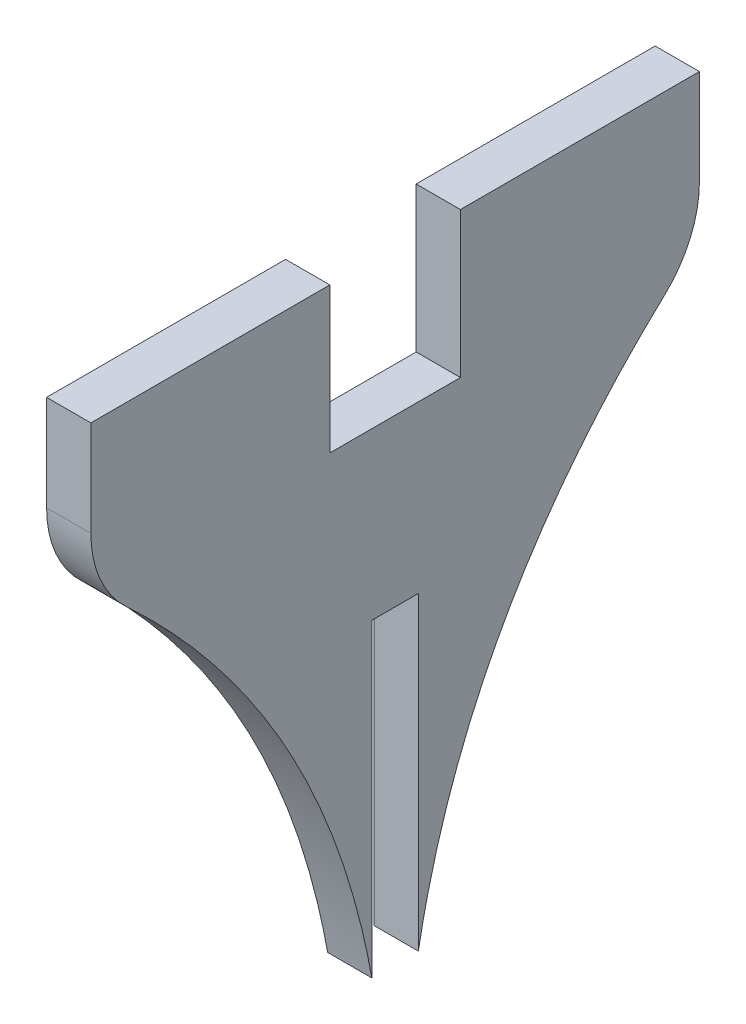
ISO-10303-21;
HEADER;
FILE_DESCRIPTION(('STEP AP214'),'2;1');
FILE_NAME('part.step','',(''),(''),'','','');
FILE_SCHEMA(('AUTOMOTIVE_DESIGN { 1 0 10303 214 1 1 1 1 }'));
ENDSEC;
DATA;
#1=APPLICATION_CONTEXT('core data for automotive mechanical design processes');
#2=APPLICATION_PROTOCOL_DEFINITION('international standard','automotive_design',2000,#1);
#3=PRODUCT_CONTEXT('',#1,'mechanical');
#4=PRODUCT('Part','Part','',(#3));
#5=PRODUCT_RELATED_PRODUCT_CATEGORY('part','',(#4));
#6=PRODUCT_DEFINITION_FORMATION('','',#4);
#7=PRODUCT_DEFINITION_CONTEXT('part definition',#1,'design');
#8=PRODUCT_DEFINITION('design','',#6,#7);
#9=PRODUCT_DEFINITION_SHAPE('','',#8);
#10=(LENGTH_UNIT() NAMED_UNIT(*) SI_UNIT(.MILLI.,.METRE.));
#11=(NAMED_UNIT(*) PLANE_ANGLE_UNIT() SI_UNIT($,.RADIAN.));
#12=(NAMED_UNIT(*) SI_UNIT($,.STERADIAN.) SOLID_ANGLE_UNIT());
#13=UNCERTAINTY_MEASURE_WITH_UNIT(LENGTH_MEASURE(1.E-05),#10,'distance_accuracy_value','');
#14=(GEOMETRIC_REPRESENTATION_CONTEXT(3) GLOBAL_UNCERTAINTY_ASSIGNED_CONTEXT((#13)) GLOBAL_UNIT_ASSIGNED_CONTEXT((#10,
#11,#12)) REPRESENTATION_CONTEXT('',''));
#15=CARTESIAN_POINT('',(0.,0.,0.));
#16=DIRECTION('',(0.,0.,1.));
#17=DIRECTION('',(1.,0.,0.));
#18=AXIS2_PLACEMENT_3D('',#15,#16,#17);
#19=CARTESIAN_POINT('',(4.,13.15,27.5));
#20=DIRECTION('',(0.,0.,-1.));
#21=DIRECTION('',(0.,1.,0.));
#22=AXIS2_PLACEMENT_3D('',#19,#20,#21);
#23=PLANE('',#22);
#24=DIRECTION('',(0.,-1.,0.));
#25=VECTOR('',#24,1.);
#26=CARTESIAN_POINT('',(0.,13.15,27.5));
#27=LINE('',#26,#25);
#28=CARTESIAN_POINT('',(0.,13.15,27.5));
#29=VERTEX_POINT('',#28);
#30=CARTESIAN_POINT('',(0.,4.50441857075632,27.5));
#31=VERTEX_POINT('',#30);
#32=EDGE_CURVE('E237',#29,#31,#27,.T.);
#33=ORIENTED_EDGE('',*,*,#32,.T.);
#34=DIRECTION('',(-1.,0.,0.));
#35=VECTOR('',#34,1.);
#36=CARTESIAN_POINT('',(4.,4.50441857075632,27.5));
#37=LINE('',#36,#35);
#38=CARTESIAN_POINT('',(4.,4.50441857075632,27.5));
#39=VERTEX_POINT('',#38);
#40=EDGE_CURVE('E12',#31,#39,#37,.F.);
#41=ORIENTED_EDGE('',*,*,#40,.T.);
#42=DIRECTION('',(0.,-1.,0.));
#43=VECTOR('',#42,1.);
#44=CARTESIAN_POINT('',(4.,13.15,27.5));
#45=LINE('',#44,#43);
#46=CARTESIAN_POINT('',(4.,13.15,27.5));
#47=VERTEX_POINT('',#46);
#48=EDGE_CURVE('E153',#47,#39,#45,.T.);
#49=ORIENTED_EDGE('',*,*,#48,.F.);
#50=DIRECTION('',(-1.,0.,0.));
#51=VECTOR('',#50,1.);
#52=CARTESIAN_POINT('',(4.,13.15,27.5));
#53=LINE('',#52,#51);
#54=EDGE_CURVE('E236',#47,#29,#53,.T.);
#55=ORIENTED_EDGE('',*,*,#54,.T.);
#56=EDGE_LOOP('',(#33,#41,#49,#55));
#57=FACE_BOUND('',#56,.T.);
#58=ADVANCED_FACE('F43',(#57),#23,.F.);
#59=CARTESIAN_POINT('',(4.,0.,27.5));
#60=CARTESIAN_POINT('',(4.,-17.4603501906166,6.73618191201682));
#61=CARTESIAN_POINT('',(4.,-43.,2.1));
#62=B_SPLINE_CURVE_WITH_KNOTS('',2,(#59,#60,#61),.UNSPECIFIED.,.F.,.F.,(3,3),(0.,1.),.UNSPECIFIED.);
#63=DIRECTION('',(-1.,0.,0.));
#64=VECTOR('',#63,1.);
#65=SURFACE_OF_LINEAR_EXTRUSION('',#62,#64);
#66=CARTESIAN_POINT('',(4.,-2.82181639797556,24.3063412479048));
#67=VERTEX_POINT('',#66);
#68=CARTESIAN_POINT('',(4.,-43.,2.1));
#69=VERTEX_POINT('',#68);
#70=EDGE_CURVE('E142',#67,#69,#62,.T.);
#71=ORIENTED_EDGE('',*,*,#70,.F.);
#72=DIRECTION('',(-1.,0.,0.));
#73=VECTOR('',#72,1.);
#74=CARTESIAN_POINT('',(4.,-2.82181639797556,24.3063412479048));
#75=LINE('',#74,#73);
#76=CARTESIAN_POINT('',(0.,-2.82181639797556,24.3063412479048));
#77=VERTEX_POINT('',#76);
#78=EDGE_CURVE('E52',#67,#77,#75,.T.);
#79=ORIENTED_EDGE('',*,*,#78,.T.);
#80=CARTESIAN_POINT('',(0.,0.,27.5));
#81=CARTESIAN_POINT('',(0.,-17.4603501906166,6.73618191201682));
#82=CARTESIAN_POINT('',(0.,-43.,2.1));
#83=B_SPLINE_CURVE_WITH_KNOTS('',2,(#80,#81,#82),.UNSPECIFIED.,.F.,.F.,(3,3),(0.,1.),.UNSPECIFIED.);
#84=CARTESIAN_POINT('',(0.,-43.,2.1));
#85=VERTEX_POINT('',#84);
#86=EDGE_CURVE('E159',#77,#85,#83,.T.);
#87=ORIENTED_EDGE('',*,*,#86,.T.);
#88=DIRECTION('',(-1.,0.,0.));
#89=VECTOR('',#88,1.);
#90=CARTESIAN_POINT('',(4.,-43.,2.1));
#91=LINE('',#90,#89);
#92=EDGE_CURVE('E156',#69,#85,#91,.T.);
#93=ORIENTED_EDGE('',*,*,#92,.F.);
#94=EDGE_LOOP('',(#71,#79,#87,#93));
#95=FACE_BOUND('',#94,.T.);
#96=ADVANCED_FACE('F157',(#95),#65,.F.);
#97=CARTESIAN_POINT('',(4.,-43.,2.1));
#98=DIRECTION('',(0.,0.,1.));
#99=DIRECTION('',(0.,-1.,0.));
#100=AXIS2_PLACEMENT_3D('',#97,#98,#99);
#101=PLANE('',#100);
#102=DIRECTION('',(0.,1.,0.));
#103=VECTOR('',#102,1.);
#104=CARTESIAN_POINT('',(0.,-43.,2.1));
#105=LINE('',#104,#103);
#106=CARTESIAN_POINT('',(0.,-15.,2.1));
#107=VERTEX_POINT('',#106);
#108=EDGE_CURVE('E244',#85,#107,#105,.T.);
#109=ORIENTED_EDGE('',*,*,#108,.T.);
#110=DIRECTION('',(-1.,0.,0.));
#111=VECTOR('',#110,1.);
#112=CARTESIAN_POINT('',(4.,-15.,2.1));
#113=LINE('',#112,#111);
#114=CARTESIAN_POINT('',(4.,-15.,2.1));
#115=VERTEX_POINT('',#114);
#116=EDGE_CURVE('E164',#115,#107,#113,.T.);
#117=ORIENTED_EDGE('',*,*,#116,.F.);
#118=DIRECTION('',(0.,1.,0.));
#119=VECTOR('',#118,1.);
#120=CARTESIAN_POINT('',(4.,-43.,2.1));
#121=LINE('',#120,#119);
#122=EDGE_CURVE('E147',#69,#115,#121,.T.);
#123=ORIENTED_EDGE('',*,*,#122,.F.);
#124=ORIENTED_EDGE('',*,*,#92,.T.);
#125=EDGE_LOOP('',(#109,#117,#123,#124));
#126=FACE_BOUND('',#125,.T.);
#127=ADVANCED_FACE('F166',(#126),#101,.F.);
#128=CARTESIAN_POINT('',(4.,-15.,2.1));
#129=DIRECTION('',(0.,1.,0.));
#130=DIRECTION('',(0.,0.,1.));
#131=AXIS2_PLACEMENT_3D('',#128,#129,#130);
#132=PLANE('',#131);
#133=DIRECTION('',(0.,0.,-1.));
#134=VECTOR('',#133,1.);
#135=CARTESIAN_POINT('',(0.,-15.,2.1));
#136=LINE('',#135,#134);
#137=CARTESIAN_POINT('',(0.,-15.,-2.1));
#138=VERTEX_POINT('',#137);
#139=EDGE_CURVE('E250',#107,#138,#136,.T.);
#140=ORIENTED_EDGE('',*,*,#139,.T.);
#141=DIRECTION('',(-1.,0.,0.));
#142=VECTOR('',#141,1.);
#143=CARTESIAN_POINT('',(4.,-15.,-2.1));
#144=LINE('',#143,#142);
#145=CARTESIAN_POINT('',(4.,-15.,-2.1));
#146=VERTEX_POINT('',#145);
#147=EDGE_CURVE('E311',#146,#138,#144,.T.);
#148=ORIENTED_EDGE('',*,*,#147,.F.);
#149=DIRECTION('',(0.,0.,-1.));
#150=VECTOR('',#149,1.);
#151=CARTESIAN_POINT('',(4.,-15.,2.1));
#152=LINE('',#151,#150);
#153=EDGE_CURVE('E170',#115,#146,#152,.T.);
#154=ORIENTED_EDGE('',*,*,#153,.F.);
#155=ORIENTED_EDGE('',*,*,#116,.T.);
#156=EDGE_LOOP('',(#140,#148,#154,#155));
#157=FACE_BOUND('',#156,.T.);
#158=ADVANCED_FACE('F377',(#157),#132,.F.);
#159=CARTESIAN_POINT('',(4.,-43.,-2.10000000000001));
#160=DIRECTION('',(0.,0.,1.));
#161=DIRECTION('',(0.,-1.,0.));
#162=AXIS2_PLACEMENT_3D('',#159,#160,#161);
#163=PLANE('',#162);
#164=DIRECTION('',(0.,1.,0.));
#165=VECTOR('',#164,1.);
#166=CARTESIAN_POINT('',(0.,-43.,-2.10000000000001));
#167=LINE('',#166,#165);
#168=CARTESIAN_POINT('',(0.,-43.,-2.10000000000001));
#169=VERTEX_POINT('',#168);
#170=EDGE_CURVE('E254',#169,#138,#167,.T.);
#171=ORIENTED_EDGE('',*,*,#170,.F.);
#172=DIRECTION('',(-1.,0.,0.));
#173=VECTOR('',#172,1.);
#174=CARTESIAN_POINT('',(4.,-43.,-2.10000000000001));
#175=LINE('',#174,#173);
#176=CARTESIAN_POINT('',(4.,-43.,-2.10000000000001));
#177=VERTEX_POINT('',#176);
#178=EDGE_CURVE('E307',#177,#169,#175,.T.);
#179=ORIENTED_EDGE('',*,*,#178,.F.);
#180=DIRECTION('',(0.,1.,0.));
#181=VECTOR('',#180,1.);
#182=CARTESIAN_POINT('',(4.,-43.,-2.10000000000001));
#183=LINE('',#182,#181);
#184=EDGE_CURVE('E174',#177,#146,#183,.T.);
#185=ORIENTED_EDGE('',*,*,#184,.T.);
#186=ORIENTED_EDGE('',*,*,#147,.T.);
#187=EDGE_LOOP('',(#171,#179,#185,#186));
#188=FACE_BOUND('',#187,.T.);
#189=ADVANCED_FACE('F381',(#188),#163,.T.);
#190=CARTESIAN_POINT('',(4.,0.,-27.5));
#191=CARTESIAN_POINT('',(4.,-17.4603501906166,-6.73618191201682));
#192=CARTESIAN_POINT('',(4.,-43.,-2.10000000000001));
#193=B_SPLINE_CURVE_WITH_KNOTS('',2,(#190,#191,#192),.UNSPECIFIED.,.F.,.F.,(3,3),(0.,1.),.UNSPECIFIED.);
#194=DIRECTION('',(-1.,0.,0.));
#195=VECTOR('',#194,1.);
#196=SURFACE_OF_LINEAR_EXTRUSION('',#193,#195);
#197=CARTESIAN_POINT('',(0.,0.,-27.5));
#198=CARTESIAN_POINT('',(0.,-17.4603501906166,-6.73618191201682));
#199=CARTESIAN_POINT('',(0.,-43.,-2.10000000000001));
#200=B_SPLINE_CURVE_WITH_KNOTS('',2,(#197,#198,#199),.UNSPECIFIED.,.F.,.F.,(3,3),(0.,1.),.UNSPECIFIED.);
#201=CARTESIAN_POINT('',(0.,-2.82181639797555,-24.3063412479048));
#202=VERTEX_POINT('',#201);
#203=EDGE_CURVE('E258',#202,#169,#200,.T.);
#204=ORIENTED_EDGE('',*,*,#203,.F.);
#205=DIRECTION('',(-1.,0.,0.));
#206=VECTOR('',#205,1.);
#207=CARTESIAN_POINT('',(0.,-2.82181639797556,-24.3063412479048));
#208=LINE('',#207,#206);
#209=CARTESIAN_POINT('',(4.,-2.82181639797555,-24.3063412479048));
#210=VERTEX_POINT('',#209);
#211=EDGE_CURVE('E193',#202,#210,#208,.F.);
#212=ORIENTED_EDGE('',*,*,#211,.T.);
#213=EDGE_CURVE('E210',#210,#177,#193,.T.);
#214=ORIENTED_EDGE('',*,*,#213,.T.);
#215=ORIENTED_EDGE('',*,*,#178,.T.);
#216=EDGE_LOOP('',(#204,#212,#214,#215));
#217=FACE_BOUND('',#216,.T.);
#218=ADVANCED_FACE('F330',(#217),#196,.T.);
#219=CARTESIAN_POINT('',(4.,13.15,-27.5));
#220=DIRECTION('',(0.,0.,-1.));
#221=DIRECTION('',(0.,1.,0.));
#222=AXIS2_PLACEMENT_3D('',#219,#220,#221);
#223=PLANE('',#222);
#224=DIRECTION('',(0.,-1.,0.));
#225=VECTOR('',#224,1.);
#226=CARTESIAN_POINT('',(4.,13.15,-27.5));
#227=LINE('',#226,#225);
#228=CARTESIAN_POINT('',(4.,13.15,-27.5));
#229=VERTEX_POINT('',#228);
#230=CARTESIAN_POINT('',(4.,4.50441857075632,-27.5));
#231=VERTEX_POINT('',#230);
#232=EDGE_CURVE('E205',#229,#231,#227,.T.);
#233=ORIENTED_EDGE('',*,*,#232,.T.);
#234=DIRECTION('',(-1.,0.,0.));
#235=VECTOR('',#234,1.);
#236=CARTESIAN_POINT('',(4.,4.50441857075632,-27.5));
#237=LINE('',#236,#235);
#238=CARTESIAN_POINT('',(0.,4.50441857075632,-27.5));
#239=VERTEX_POINT('',#238);
#240=EDGE_CURVE('E163',#231,#239,#237,.T.);
#241=ORIENTED_EDGE('',*,*,#240,.T.);
#242=DIRECTION('',(0.,-1.,0.));
#243=VECTOR('',#242,1.);
#244=CARTESIAN_POINT('',(0.,13.15,-27.5));
#245=LINE('',#244,#243);
#246=CARTESIAN_POINT('',(0.,13.15,-27.5));
#247=VERTEX_POINT('',#246);
#248=EDGE_CURVE('E263',#247,#239,#245,.T.);
#249=ORIENTED_EDGE('',*,*,#248,.F.);
#250=DIRECTION('',(-1.,0.,0.));
#251=VECTOR('',#250,1.);
#252=CARTESIAN_POINT('',(4.,13.15,-27.5));
#253=LINE('',#252,#251);
#254=EDGE_CURVE('E304',#229,#247,#253,.T.);
#255=ORIENTED_EDGE('',*,*,#254,.F.);
#256=EDGE_LOOP('',(#233,#241,#249,#255));
#257=FACE_BOUND('',#256,.T.);
#258=ADVANCED_FACE('F342',(#257),#223,.T.);
#259=CARTESIAN_POINT('',(4.,13.15,-27.5));
#260=DIRECTION('',(0.,-1.,0.));
#261=DIRECTION('',(0.,0.,-1.));
#262=AXIS2_PLACEMENT_3D('',#259,#260,#261);
#263=PLANE('',#262);
#264=DIRECTION('',(0.,0.,1.));
#265=VECTOR('',#264,1.);
#266=CARTESIAN_POINT('',(0.,13.15,-27.5));
#267=LINE('',#266,#265);
#268=CARTESIAN_POINT('',(0.,13.15,-5.9));
#269=VERTEX_POINT('',#268);
#270=EDGE_CURVE('E270',#247,#269,#267,.T.);
#271=ORIENTED_EDGE('',*,*,#270,.T.);
#272=DIRECTION('',(-1.,0.,0.));
#273=VECTOR('',#272,1.);
#274=CARTESIAN_POINT('',(4.,13.15,-5.9));
#275=LINE('',#274,#273);
#276=CARTESIAN_POINT('',(4.,13.15,-5.9));
#277=VERTEX_POINT('',#276);
#278=EDGE_CURVE('E300',#277,#269,#275,.T.);
#279=ORIENTED_EDGE('',*,*,#278,.F.);
#280=DIRECTION('',(0.,0.,1.));
#281=VECTOR('',#280,1.);
#282=CARTESIAN_POINT('',(4.,13.15,-27.5));
#283=LINE('',#282,#281);
#284=EDGE_CURVE('E209',#229,#277,#283,.T.);
#285=ORIENTED_EDGE('',*,*,#284,.F.);
#286=ORIENTED_EDGE('',*,*,#254,.T.);
#287=EDGE_LOOP('',(#271,#279,#285,#286));
#288=FACE_BOUND('',#287,.T.);
#289=ADVANCED_FACE('F348',(#288),#263,.F.);
#290=CARTESIAN_POINT('',(4.,13.15,-5.9));
#291=DIRECTION('',(0.,0.,-1.));
#292=DIRECTION('',(0.,1.,0.));
#293=AXIS2_PLACEMENT_3D('',#290,#291,#292);
#294=PLANE('',#293);
#295=DIRECTION('',(0.,-1.,0.));
#296=VECTOR('',#295,1.);
#297=CARTESIAN_POINT('',(0.,13.15,-5.9));
#298=LINE('',#297,#296);
#299=CARTESIAN_POINT('',(0.,0.,-5.9));
#300=VERTEX_POINT('',#299);
#301=EDGE_CURVE('E273',#269,#300,#298,.T.);
#302=ORIENTED_EDGE('',*,*,#301,.T.);
#303=DIRECTION('',(-1.,0.,0.));
#304=VECTOR('',#303,1.);
#305=CARTESIAN_POINT('',(4.,0.,-5.9));
#306=LINE('',#305,#304);
#307=CARTESIAN_POINT('',(4.,0.,-5.9));
#308=VERTEX_POINT('',#307);
#309=EDGE_CURVE('E297',#308,#300,#306,.T.);
#310=ORIENTED_EDGE('',*,*,#309,.F.);
#311=DIRECTION('',(0.,-1.,0.));
#312=VECTOR('',#311,1.);
#313=CARTESIAN_POINT('',(4.,13.15,-5.9));
#314=LINE('',#313,#312);
#315=EDGE_CURVE('E217',#277,#308,#314,.T.);
#316=ORIENTED_EDGE('',*,*,#315,.F.);
#317=ORIENTED_EDGE('',*,*,#278,.T.);
#318=EDGE_LOOP('',(#302,#310,#316,#317));
#319=FACE_BOUND('',#318,.T.);
#320=ADVANCED_FACE('F352',(#319),#294,.F.);
#321=CARTESIAN_POINT('',(4.,0.,5.9));
#322=DIRECTION('',(0.,1.,0.));
#323=DIRECTION('',(0.,0.,1.));
#324=AXIS2_PLACEMENT_3D('',#321,#322,#323);
#325=PLANE('',#324);
#326=DIRECTION('',(0.,0.,-1.));
#327=VECTOR('',#326,1.);
#328=CARTESIAN_POINT('',(0.,0.,5.9));
#329=LINE('',#328,#327);
#330=CARTESIAN_POINT('',(0.,0.,5.9));
#331=VERTEX_POINT('',#330);
#332=EDGE_CURVE('E277',#331,#300,#329,.T.);
#333=ORIENTED_EDGE('',*,*,#332,.F.);
#334=DIRECTION('',(-1.,0.,0.));
#335=VECTOR('',#334,1.);
#336=CARTESIAN_POINT('',(4.,0.,5.9));
#337=LINE('',#336,#335);
#338=CARTESIAN_POINT('',(4.,0.,5.9));
#339=VERTEX_POINT('',#338);
#340=EDGE_CURVE('E294',#339,#331,#337,.T.);
#341=ORIENTED_EDGE('',*,*,#340,.F.);
#342=DIRECTION('',(0.,0.,-1.));
#343=VECTOR('',#342,1.);
#344=CARTESIAN_POINT('',(4.,0.,5.9));
#345=LINE('',#344,#343);
#346=EDGE_CURVE('E221',#339,#308,#345,.T.);
#347=ORIENTED_EDGE('',*,*,#346,.T.);
#348=ORIENTED_EDGE('',*,*,#309,.T.);
#349=EDGE_LOOP('',(#333,#341,#347,#348));
#350=FACE_BOUND('',#349,.T.);
#351=ADVANCED_FACE('F435',(#350),#325,.T.);
#352=CARTESIAN_POINT('',(4.,13.15,5.9));
#353=DIRECTION('',(0.,0.,-1.));
#354=DIRECTION('',(0.,1.,0.));
#355=AXIS2_PLACEMENT_3D('',#352,#353,#354);
#356=PLANE('',#355);
#357=DIRECTION('',(0.,-1.,0.));
#358=VECTOR('',#357,1.);
#359=CARTESIAN_POINT('',(0.,13.15,5.9));
#360=LINE('',#359,#358);
#361=CARTESIAN_POINT('',(0.,13.15,5.9));
#362=VERTEX_POINT('',#361);
#363=EDGE_CURVE('E281',#362,#331,#360,.T.);
#364=ORIENTED_EDGE('',*,*,#363,.F.);
#365=DIRECTION('',(-1.,0.,0.));
#366=VECTOR('',#365,1.);
#367=CARTESIAN_POINT('',(4.,13.15,5.9));
#368=LINE('',#367,#366);
#369=CARTESIAN_POINT('',(4.,13.15,5.9));
#370=VERTEX_POINT('',#369);
#371=EDGE_CURVE('E291',#370,#362,#368,.T.);
#372=ORIENTED_EDGE('',*,*,#371,.F.);
#373=DIRECTION('',(0.,-1.,0.));
#374=VECTOR('',#373,1.);
#375=CARTESIAN_POINT('',(4.,13.15,5.9));
#376=LINE('',#375,#374);
#377=EDGE_CURVE('E227',#370,#339,#376,.T.);
#378=ORIENTED_EDGE('',*,*,#377,.T.);
#379=ORIENTED_EDGE('',*,*,#340,.T.);
#380=EDGE_LOOP('',(#364,#372,#378,#379));
#381=FACE_BOUND('',#380,.T.);
#382=ADVANCED_FACE('F362',(#381),#356,.T.);
#383=CARTESIAN_POINT('',(4.,13.15,27.5));
#384=DIRECTION('',(0.,1.,0.));
#385=DIRECTION('',(0.,0.,1.));
#386=AXIS2_PLACEMENT_3D('',#383,#384,#385);
#387=PLANE('',#386);
#388=DIRECTION('',(0.,0.,-1.));
#389=VECTOR('',#388,1.);
#390=CARTESIAN_POINT('',(0.,13.15,27.5));
#391=LINE('',#390,#389);
#392=EDGE_CURVE('E285',#29,#362,#391,.T.);
#393=ORIENTED_EDGE('',*,*,#392,.F.);
#394=ORIENTED_EDGE('',*,*,#54,.F.);
#395=DIRECTION('',(0.,0.,-1.));
#396=VECTOR('',#395,1.);
#397=CARTESIAN_POINT('',(4.,13.15,27.5));
#398=LINE('',#397,#396);
#399=EDGE_CURVE('E231',#47,#370,#398,.T.);
#400=ORIENTED_EDGE('',*,*,#399,.T.);
#401=ORIENTED_EDGE('',*,*,#371,.T.);
#402=EDGE_LOOP('',(#393,#394,#400,#401));
#403=FACE_BOUND('',#402,.T.);
#404=ADVANCED_FACE('F366',(#403),#387,.T.);
#405=CARTESIAN_POINT('',(4.,-19.4801750953083,10.7680909560084));
#406=DIRECTION('',(1.,0.,0.));
#407=DIRECTION('',(0.,0.,-1.));
#408=AXIS2_PLACEMENT_3D('',#405,#406,#407);
#409=PLANE('',#408);
#410=ORIENTED_EDGE('',*,*,#213,.F.);
#411=CARTESIAN_POINT('',(4.,4.50441857075632,-17.5));
#412=DIRECTION('',(1.,0.,0.));
#413=DIRECTION('',(0.,0.,-1.));
#414=AXIS2_PLACEMENT_3D('',#411,#412,#413);
#415=CIRCLE('',#414,10.);
#416=EDGE_CURVE('E192',#210,#231,#415,.T.);
#417=ORIENTED_EDGE('',*,*,#416,.T.);
#418=ORIENTED_EDGE('',*,*,#232,.F.);
#419=ORIENTED_EDGE('',*,*,#284,.T.);
#420=ORIENTED_EDGE('',*,*,#315,.T.);
#421=ORIENTED_EDGE('',*,*,#346,.F.);
#422=ORIENTED_EDGE('',*,*,#377,.F.);
#423=ORIENTED_EDGE('',*,*,#399,.F.);
#424=ORIENTED_EDGE('',*,*,#48,.T.);
#425=CARTESIAN_POINT('',(4.,4.50441857075632,17.5));
#426=DIRECTION('',(1.,0.,0.));
#427=DIRECTION('',(0.,0.,-1.));
#428=AXIS2_PLACEMENT_3D('',#425,#426,#427);
#429=CIRCLE('',#428,10.);
#430=EDGE_CURVE('E59',#39,#67,#429,.T.);
#431=ORIENTED_EDGE('',*,*,#430,.T.);
#432=ORIENTED_EDGE('',*,*,#70,.T.);
#433=ORIENTED_EDGE('',*,*,#122,.T.);
#434=ORIENTED_EDGE('',*,*,#153,.T.);
#435=ORIENTED_EDGE('',*,*,#184,.F.);
#436=EDGE_LOOP('',(#410,#417,#418,#419,#420,#421,#422,#423,#424,#431,#432,#433,#434,#435));
#437=FACE_BOUND('',#436,.T.);
#438=ADVANCED_FACE('F145',(#437),#409,.T.);
#439=CARTESIAN_POINT('',(0.,-19.4801750953083,10.7680909560084));
#440=DIRECTION('',(1.,0.,0.));
#441=DIRECTION('',(0.,0.,-1.));
#442=AXIS2_PLACEMENT_3D('',#439,#440,#441);
#443=PLANE('',#442);
#444=ORIENTED_EDGE('',*,*,#248,.T.);
#445=CARTESIAN_POINT('',(0.,4.50441857075632,-17.5));
#446=DIRECTION('',(1.,0.,0.));
#447=DIRECTION('',(0.,0.,-1.));
#448=AXIS2_PLACEMENT_3D('',#445,#446,#447);
#449=CIRCLE('',#448,10.);
#450=EDGE_CURVE('E321',#239,#202,#449,.F.);
#451=ORIENTED_EDGE('',*,*,#450,.T.);
#452=ORIENTED_EDGE('',*,*,#203,.T.);
#453=ORIENTED_EDGE('',*,*,#170,.T.);
#454=ORIENTED_EDGE('',*,*,#139,.F.);
#455=ORIENTED_EDGE('',*,*,#108,.F.);
#456=ORIENTED_EDGE('',*,*,#86,.F.);
#457=CARTESIAN_POINT('',(0.,4.50441857075632,17.5));
#458=DIRECTION('',(1.,0.,0.));
#459=DIRECTION('',(0.,0.,-1.));
#460=AXIS2_PLACEMENT_3D('',#457,#458,#459);
#461=CIRCLE('',#460,10.);
#462=EDGE_CURVE('E319',#77,#31,#461,.F.);
#463=ORIENTED_EDGE('',*,*,#462,.T.);
#464=ORIENTED_EDGE('',*,*,#32,.F.);
#465=ORIENTED_EDGE('',*,*,#392,.T.);
#466=ORIENTED_EDGE('',*,*,#363,.T.);
#467=ORIENTED_EDGE('',*,*,#332,.T.);
#468=ORIENTED_EDGE('',*,*,#301,.F.);
#469=ORIENTED_EDGE('',*,*,#270,.F.);
#470=EDGE_LOOP('',(#444,#451,#452,#453,#454,#455,#456,#463,#464,#465,#466,#467,#468,#469));
#471=FACE_BOUND('',#470,.T.);
#472=ADVANCED_FACE('F344',(#471),#443,.F.);
#473=CARTESIAN_POINT('',(2.,4.50441857075632,-17.5));
#474=DIRECTION('',(-1.,0.,0.));
#475=DIRECTION('',(0.,0.,1.));
#476=AXIS2_PLACEMENT_3D('',#473,#474,#475);
#477=CYLINDRICAL_SURFACE('',#476,10.);
#478=ORIENTED_EDGE('',*,*,#416,.F.);
#479=ORIENTED_EDGE('',*,*,#211,.F.);
#480=ORIENTED_EDGE('',*,*,#450,.F.);
#481=ORIENTED_EDGE('',*,*,#240,.F.);
#482=EDGE_LOOP('',(#478,#479,#480,#481));
#483=FACE_BOUND('',#482,.T.);
#484=ADVANCED_FACE('F339',(#483),#477,.T.);
#485=CARTESIAN_POINT('',(2.,4.50441857075632,17.5));
#486=DIRECTION('',(-1.,0.,0.));
#487=DIRECTION('',(0.,0.,1.));
#488=AXIS2_PLACEMENT_3D('',#485,#486,#487);
#489=CYLINDRICAL_SURFACE('',#488,10.);
#490=ORIENTED_EDGE('',*,*,#430,.F.);
#491=ORIENTED_EDGE('',*,*,#40,.F.);
#492=ORIENTED_EDGE('',*,*,#462,.F.);
#493=ORIENTED_EDGE('',*,*,#78,.F.);
#494=EDGE_LOOP('',(#490,#491,#492,#493));
#495=FACE_BOUND('',#494,.T.);
#496=ADVANCED_FACE('F45',(#495),#489,.T.);
#497=CLOSED_SHELL('',(#58,#96,#127,#158,#189,#218,#258,#289,#320,#351,#382,#404,#438,#472,#484,#496));
#498=MANIFOLD_SOLID_BREP('B2',#497);
#499=ADVANCED_BREP_SHAPE_REPRESENTATION('',(#18,#498),#14);
#500=SHAPE_DEFINITION_REPRESENTATION(#9,#499);
ENDSEC;
END-ISO-10303-21;
